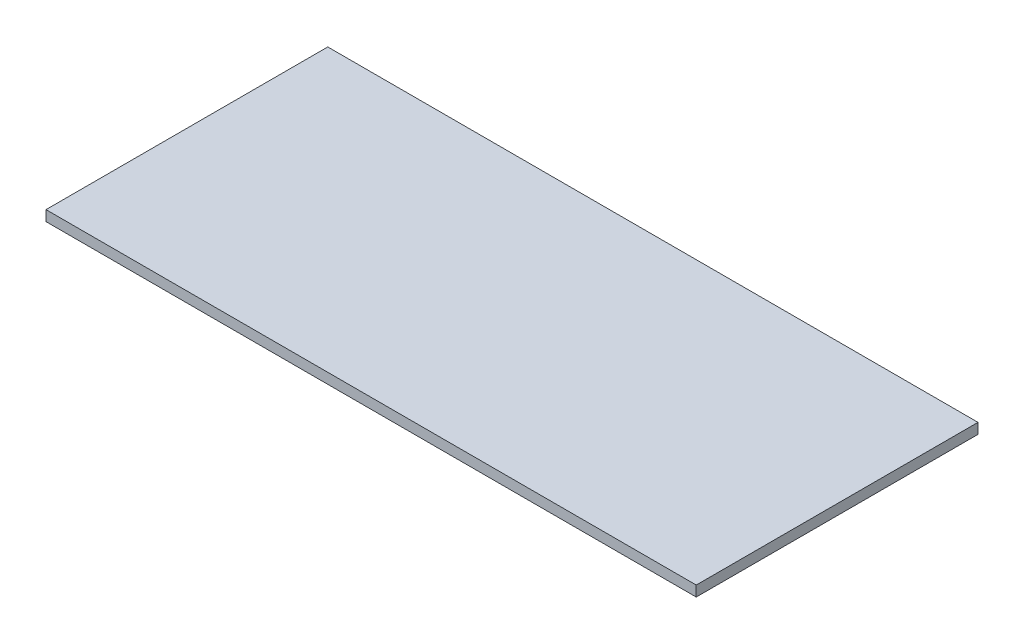
ISO-10303-21;
HEADER;
FILE_DESCRIPTION(('STEP AP214'),'2;1');
FILE_NAME('part.step','',(''),(''),'','','');
FILE_SCHEMA(('AUTOMOTIVE_DESIGN { 1 0 10303 214 1 1 1 1 }'));
ENDSEC;
DATA;
#1=APPLICATION_CONTEXT('core data for automotive mechanical design processes');
#2=APPLICATION_PROTOCOL_DEFINITION('international standard','automotive_design',2000,#1);
#3=PRODUCT_CONTEXT('',#1,'mechanical');
#4=PRODUCT('Part','Part','',(#3));
#5=PRODUCT_RELATED_PRODUCT_CATEGORY('part','',(#4));
#6=PRODUCT_DEFINITION_FORMATION('','',#4);
#7=PRODUCT_DEFINITION_CONTEXT('part definition',#1,'design');
#8=PRODUCT_DEFINITION('design','',#6,#7);
#9=PRODUCT_DEFINITION_SHAPE('','',#8);
#10=(LENGTH_UNIT() NAMED_UNIT(*) SI_UNIT(.MILLI.,.METRE.));
#11=(NAMED_UNIT(*) PLANE_ANGLE_UNIT() SI_UNIT($,.RADIAN.));
#12=(NAMED_UNIT(*) SI_UNIT($,.STERADIAN.) SOLID_ANGLE_UNIT());
#13=UNCERTAINTY_MEASURE_WITH_UNIT(LENGTH_MEASURE(1.E-05),#10,'distance_accuracy_value','');
#14=(GEOMETRIC_REPRESENTATION_CONTEXT(3) GLOBAL_UNCERTAINTY_ASSIGNED_CONTEXT((#13)) GLOBAL_UNIT_ASSIGNED_CONTEXT((#10,
#11,#12)) REPRESENTATION_CONTEXT('',''));
#15=CARTESIAN_POINT('',(0.,0.,0.));
#16=DIRECTION('',(0.,0.,1.));
#17=DIRECTION('',(1.,0.,0.));
#18=AXIS2_PLACEMENT_3D('',#15,#16,#17);
#19=CARTESIAN_POINT('',(-190.5,6.11,82.55));
#20=DIRECTION('',(1.,0.,0.));
#21=DIRECTION('',(0.,0.,-1.));
#22=AXIS2_PLACEMENT_3D('',#19,#20,#21);
#23=PLANE('',#22);
#24=DIRECTION('',(0.,0.,1.));
#25=VECTOR('',#24,1.);
#26=CARTESIAN_POINT('',(-190.5,0.,82.55));
#27=LINE('',#26,#25);
#28=CARTESIAN_POINT('',(-190.5,0.,-82.55));
#29=VERTEX_POINT('',#28);
#30=CARTESIAN_POINT('',(-190.5,0.,82.55));
#31=VERTEX_POINT('',#30);
#32=EDGE_CURVE('E96',#29,#31,#27,.T.);
#33=ORIENTED_EDGE('',*,*,#32,.T.);
#34=DIRECTION('',(0.,-1.,0.));
#35=VECTOR('',#34,1.);
#36=CARTESIAN_POINT('',(-190.5,6.11,82.55));
#37=LINE('',#36,#35);
#38=CARTESIAN_POINT('',(-190.5,6.11,82.55));
#39=VERTEX_POINT('',#38);
#40=EDGE_CURVE('E11',#39,#31,#37,.T.);
#41=ORIENTED_EDGE('',*,*,#40,.F.);
#42=DIRECTION('',(0.,0.,1.));
#43=VECTOR('',#42,1.);
#44=CARTESIAN_POINT('',(-190.5,6.11,82.55));
#45=LINE('',#44,#43);
#46=CARTESIAN_POINT('',(-190.5,6.11,-82.55));
#47=VERTEX_POINT('',#46);
#48=EDGE_CURVE('E84',#47,#39,#45,.T.);
#49=ORIENTED_EDGE('',*,*,#48,.F.);
#50=DIRECTION('',(0.,-1.,0.));
#51=VECTOR('',#50,1.);
#52=CARTESIAN_POINT('',(-190.5,6.11,-82.55));
#53=LINE('',#52,#51);
#54=EDGE_CURVE('E92',#47,#29,#53,.T.);
#55=ORIENTED_EDGE('',*,*,#54,.T.);
#56=EDGE_LOOP('',(#33,#41,#49,#55));
#57=FACE_BOUND('',#56,.T.);
#58=ADVANCED_FACE('F33',(#57),#23,.F.);
#59=CARTESIAN_POINT('',(190.5,6.11,82.55));
#60=DIRECTION('',(0.,0.,-1.));
#61=DIRECTION('',(-1.,0.,0.));
#62=AXIS2_PLACEMENT_3D('',#59,#60,#61);
#63=PLANE('',#62);
#64=DIRECTION('',(1.,0.,0.));
#65=VECTOR('',#64,1.);
#66=CARTESIAN_POINT('',(190.5,0.,82.55));
#67=LINE('',#66,#65);
#68=CARTESIAN_POINT('',(190.5,0.,82.55));
#69=VERTEX_POINT('',#68);
#70=EDGE_CURVE('E88',#31,#69,#67,.T.);
#71=ORIENTED_EDGE('',*,*,#70,.T.);
#72=DIRECTION('',(0.,-1.,0.));
#73=VECTOR('',#72,1.);
#74=CARTESIAN_POINT('',(190.5,6.11,82.55));
#75=LINE('',#74,#73);
#76=CARTESIAN_POINT('',(190.5,6.11,82.55));
#77=VERTEX_POINT('',#76);
#78=EDGE_CURVE('E41',#77,#69,#75,.T.);
#79=ORIENTED_EDGE('',*,*,#78,.F.);
#80=DIRECTION('',(1.,0.,0.));
#81=VECTOR('',#80,1.);
#82=CARTESIAN_POINT('',(190.5,6.11,82.55));
#83=LINE('',#82,#81);
#84=EDGE_CURVE('E79',#39,#77,#83,.T.);
#85=ORIENTED_EDGE('',*,*,#84,.F.);
#86=ORIENTED_EDGE('',*,*,#40,.T.);
#87=EDGE_LOOP('',(#71,#79,#85,#86));
#88=FACE_BOUND('',#87,.T.);
#89=ADVANCED_FACE('F87',(#88),#63,.F.);
#90=CARTESIAN_POINT('',(190.5,6.11,82.55));
#91=DIRECTION('',(-1.,0.,0.));
#92=DIRECTION('',(0.,0.,1.));
#93=AXIS2_PLACEMENT_3D('',#90,#91,#92);
#94=PLANE('',#93);
#95=DIRECTION('',(0.,0.,-1.));
#96=VECTOR('',#95,1.);
#97=CARTESIAN_POINT('',(190.5,0.,82.55));
#98=LINE('',#97,#96);
#99=CARTESIAN_POINT('',(190.5,0.,-82.55));
#100=VERTEX_POINT('',#99);
#101=EDGE_CURVE('E66',#69,#100,#98,.T.);
#102=ORIENTED_EDGE('',*,*,#101,.T.);
#103=DIRECTION('',(0.,-1.,0.));
#104=VECTOR('',#103,1.);
#105=CARTESIAN_POINT('',(190.5,6.11,-82.55));
#106=LINE('',#105,#104);
#107=CARTESIAN_POINT('',(190.5,6.11,-82.55));
#108=VERTEX_POINT('',#107);
#109=EDGE_CURVE('E89',#108,#100,#106,.T.);
#110=ORIENTED_EDGE('',*,*,#109,.F.);
#111=DIRECTION('',(0.,0.,-1.));
#112=VECTOR('',#111,1.);
#113=CARTESIAN_POINT('',(190.5,6.11,82.55));
#114=LINE('',#113,#112);
#115=EDGE_CURVE('E82',#77,#108,#114,.T.);
#116=ORIENTED_EDGE('',*,*,#115,.F.);
#117=ORIENTED_EDGE('',*,*,#78,.T.);
#118=EDGE_LOOP('',(#102,#110,#116,#117));
#119=FACE_BOUND('',#118,.T.);
#120=ADVANCED_FACE('F90',(#119),#94,.F.);
#121=CARTESIAN_POINT('',(190.5,6.11,-82.55));
#122=DIRECTION('',(0.,0.,1.));
#123=DIRECTION('',(1.,0.,0.));
#124=AXIS2_PLACEMENT_3D('',#121,#122,#123);
#125=PLANE('',#124);
#126=DIRECTION('',(-1.,0.,0.));
#127=VECTOR('',#126,1.);
#128=CARTESIAN_POINT('',(190.5,0.,-82.55));
#129=LINE('',#128,#127);
#130=EDGE_CURVE('E72',#100,#29,#129,.T.);
#131=ORIENTED_EDGE('',*,*,#130,.T.);
#132=ORIENTED_EDGE('',*,*,#54,.F.);
#133=DIRECTION('',(-1.,0.,0.));
#134=VECTOR('',#133,1.);
#135=CARTESIAN_POINT('',(190.5,6.11,-82.55));
#136=LINE('',#135,#134);
#137=EDGE_CURVE('E49',#108,#47,#136,.T.);
#138=ORIENTED_EDGE('',*,*,#137,.F.);
#139=ORIENTED_EDGE('',*,*,#109,.T.);
#140=EDGE_LOOP('',(#131,#132,#138,#139));
#141=FACE_BOUND('',#140,.T.);
#142=ADVANCED_FACE('F103',(#141),#125,.F.);
#143=CARTESIAN_POINT('',(0.,6.11,0.));
#144=DIRECTION('',(0.,1.,0.));
#145=DIRECTION('',(0.,0.,1.));
#146=AXIS2_PLACEMENT_3D('',#143,#144,#145);
#147=PLANE('',#146);
#148=ORIENTED_EDGE('',*,*,#48,.T.);
#149=ORIENTED_EDGE('',*,*,#84,.T.);
#150=ORIENTED_EDGE('',*,*,#115,.T.);
#151=ORIENTED_EDGE('',*,*,#137,.T.);
#152=EDGE_LOOP('',(#148,#149,#150,#151));
#153=FACE_BOUND('',#152,.T.);
#154=ADVANCED_FACE('F80',(#153),#147,.T.);
#155=CARTESIAN_POINT('',(0.,0.,0.));
#156=DIRECTION('',(0.,1.,0.));
#157=DIRECTION('',(0.,0.,1.));
#158=AXIS2_PLACEMENT_3D('',#155,#156,#157);
#159=PLANE('',#158);
#160=ORIENTED_EDGE('',*,*,#32,.F.);
#161=ORIENTED_EDGE('',*,*,#130,.F.);
#162=ORIENTED_EDGE('',*,*,#101,.F.);
#163=ORIENTED_EDGE('',*,*,#70,.F.);
#164=EDGE_LOOP('',(#160,#161,#162,#163));
#165=FACE_BOUND('',#164,.T.);
#166=ADVANCED_FACE('F106',(#165),#159,.F.);
#167=CLOSED_SHELL('',(#58,#89,#120,#142,#154,#166));
#168=MANIFOLD_SOLID_BREP('B2',#167);
#169=ADVANCED_BREP_SHAPE_REPRESENTATION('',(#18,#168),#14);
#170=SHAPE_DEFINITION_REPRESENTATION(#9,#169);
ENDSEC;
END-ISO-10303-21;
